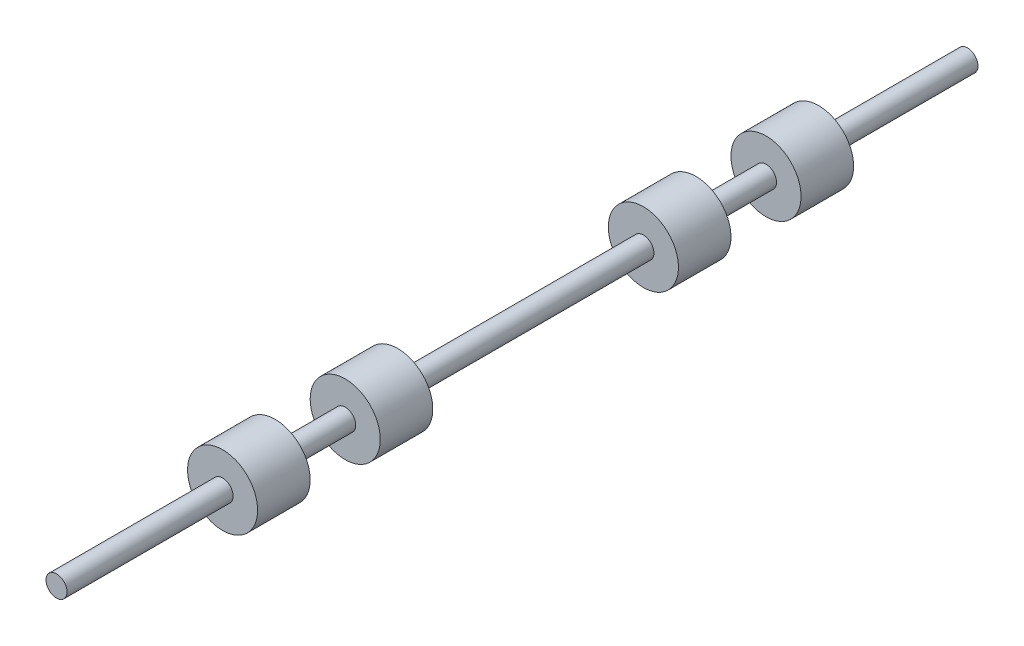
ISO-10303-21;
HEADER;
FILE_DESCRIPTION(('STEP AP214'),'2;1');
FILE_NAME('part.step','',(''),(''),'','','');
FILE_SCHEMA(('AUTOMOTIVE_DESIGN { 1 0 10303 214 1 1 1 1 }'));
ENDSEC;
DATA;
#1=APPLICATION_CONTEXT('core data for automotive mechanical design processes');
#2=APPLICATION_PROTOCOL_DEFINITION('international standard','automotive_design',2000,#1);
#3=PRODUCT_CONTEXT('',#1,'mechanical');
#4=PRODUCT('Part','Part','',(#3));
#5=PRODUCT_RELATED_PRODUCT_CATEGORY('part','',(#4));
#6=PRODUCT_DEFINITION_FORMATION('','',#4);
#7=PRODUCT_DEFINITION_CONTEXT('part definition',#1,'design');
#8=PRODUCT_DEFINITION('design','',#6,#7);
#9=PRODUCT_DEFINITION_SHAPE('','',#8);
#10=(LENGTH_UNIT() NAMED_UNIT(*) SI_UNIT(.MILLI.,.METRE.));
#11=(NAMED_UNIT(*) PLANE_ANGLE_UNIT() SI_UNIT($,.RADIAN.));
#12=(NAMED_UNIT(*) SI_UNIT($,.STERADIAN.) SOLID_ANGLE_UNIT());
#13=UNCERTAINTY_MEASURE_WITH_UNIT(LENGTH_MEASURE(1.E-05),#10,'distance_accuracy_value','');
#14=(GEOMETRIC_REPRESENTATION_CONTEXT(3) GLOBAL_UNCERTAINTY_ASSIGNED_CONTEXT((#13)) GLOBAL_UNIT_ASSIGNED_CONTEXT((#10,
#11,#12)) REPRESENTATION_CONTEXT('',''));
#15=CARTESIAN_POINT('',(0.,0.,0.));
#16=DIRECTION('',(0.,0.,1.));
#17=DIRECTION('',(1.,0.,0.));
#18=AXIS2_PLACEMENT_3D('',#15,#16,#17);
#19=CARTESIAN_POINT('',(0.,0.,26.));
#20=DIRECTION('',(0.,0.,-1.));
#21=DIRECTION('',(-1.,0.,0.));
#22=AXIS2_PLACEMENT_3D('',#19,#20,#21);
#23=CYLINDRICAL_SURFACE('',#22,0.3);
#24=CARTESIAN_POINT('',(0.,0.,17.76));
#25=DIRECTION('',(0.,0.,-1.));
#26=DIRECTION('',(-1.,0.,0.));
#27=AXIS2_PLACEMENT_3D('',#24,#25,#26);
#28=CIRCLE('',#27,0.3);
#29=CARTESIAN_POINT('',(-0.3,0.,17.76));
#30=VERTEX_POINT('',#29);
#31=EDGE_CURVE('E42',#30,#30,#28,.T.);
#32=ORIENTED_EDGE('',*,*,#31,.F.);
#33=EDGE_LOOP('',(#32));
#34=FACE_BOUND('',#33,.T.);
#35=CARTESIAN_POINT('',(0.,0.,19.76));
#36=DIRECTION('',(0.,0.,1.));
#37=DIRECTION('',(1.,0.,0.));
#38=AXIS2_PLACEMENT_3D('',#35,#36,#37);
#39=CIRCLE('',#38,0.3);
#40=CARTESIAN_POINT('',(0.3,0.,19.76));
#41=VERTEX_POINT('',#40);
#42=EDGE_CURVE('E38',#41,#41,#39,.T.);
#43=ORIENTED_EDGE('',*,*,#42,.F.);
#44=EDGE_LOOP('',(#43));
#45=FACE_BOUND('',#44,.T.);
#46=ADVANCED_FACE('F31',(#34,#45),#23,.T.);
#47=CARTESIAN_POINT('',(0.,0.,9.25));
#48=DIRECTION('',(0.,0.,-1.));
#49=DIRECTION('',(-1.,0.,0.));
#50=AXIS2_PLACEMENT_3D('',#47,#48,#49);
#51=CIRCLE('',#50,0.3);
#52=CARTESIAN_POINT('',(-0.3,0.,9.25));
#53=VERTEX_POINT('',#52);
#54=EDGE_CURVE('E51',#53,#53,#51,.T.);
#55=ORIENTED_EDGE('',*,*,#54,.F.);
#56=EDGE_LOOP('',(#55));
#57=FACE_BOUND('',#56,.T.);
#58=CARTESIAN_POINT('',(0.,0.,16.26));
#59=DIRECTION('',(0.,0.,1.));
#60=DIRECTION('',(1.,0.,0.));
#61=AXIS2_PLACEMENT_3D('',#58,#59,#60);
#62=CIRCLE('',#61,0.3);
#63=CARTESIAN_POINT('',(0.3,0.,16.26));
#64=VERTEX_POINT('',#63);
#65=EDGE_CURVE('E46',#64,#64,#62,.T.);
#66=ORIENTED_EDGE('',*,*,#65,.F.);
#67=EDGE_LOOP('',(#66));
#68=FACE_BOUND('',#67,.T.);
#69=ADVANCED_FACE('F113',(#57,#68),#23,.T.);
#70=CARTESIAN_POINT('',(0.,0.,5.75));
#71=DIRECTION('',(0.,0.,-1.));
#72=DIRECTION('',(-1.,0.,0.));
#73=AXIS2_PLACEMENT_3D('',#70,#71,#72);
#74=CIRCLE('',#73,0.3);
#75=CARTESIAN_POINT('',(-0.3,0.,5.75));
#76=VERTEX_POINT('',#75);
#77=EDGE_CURVE('E57',#76,#76,#74,.T.);
#78=ORIENTED_EDGE('',*,*,#77,.F.);
#79=EDGE_LOOP('',(#78));
#80=FACE_BOUND('',#79,.T.);
#81=CARTESIAN_POINT('',(0.,0.,7.75));
#82=DIRECTION('',(0.,0.,1.));
#83=DIRECTION('',(1.,0.,0.));
#84=AXIS2_PLACEMENT_3D('',#81,#82,#83);
#85=CIRCLE('',#84,0.3);
#86=CARTESIAN_POINT('',(0.3,0.,7.75));
#87=VERTEX_POINT('',#86);
#88=EDGE_CURVE('E54',#87,#87,#85,.T.);
#89=ORIENTED_EDGE('',*,*,#88,.F.);
#90=EDGE_LOOP('',(#89));
#91=FACE_BOUND('',#90,.T.);
#92=ADVANCED_FACE('F118',(#80,#91),#23,.T.);
#93=CARTESIAN_POINT('',(0.,0.,5.75));
#94=DIRECTION('',(0.,0.,-1.));
#95=DIRECTION('',(-1.,0.,0.));
#96=AXIS2_PLACEMENT_3D('',#93,#94,#95);
#97=PLANE('',#96);
#98=ORIENTED_EDGE('',*,*,#77,.T.);
#99=EDGE_LOOP('',(#98));
#100=FACE_BOUND('',#99,.T.);
#101=CARTESIAN_POINT('',(0.,0.,5.75));
#102=DIRECTION('',(0.,0.,-1.));
#103=DIRECTION('',(-1.,0.,0.));
#104=AXIS2_PLACEMENT_3D('',#101,#102,#103);
#105=CIRCLE('',#104,1.);
#106=CARTESIAN_POINT('',(-1.,0.,5.75));
#107=VERTEX_POINT('',#106);
#108=EDGE_CURVE('E67',#107,#107,#105,.T.);
#109=ORIENTED_EDGE('',*,*,#108,.F.);
#110=EDGE_LOOP('',(#109));
#111=FACE_BOUND('',#110,.T.);
#112=ADVANCED_FACE('F148',(#100,#111),#97,.F.);
#113=CARTESIAN_POINT('',(0.,0.,0.));
#114=DIRECTION('',(0.,0.,-1.));
#115=DIRECTION('',(-1.,0.,0.));
#116=AXIS2_PLACEMENT_3D('',#113,#114,#115);
#117=CYLINDRICAL_SURFACE('',#116,1.);
#118=CARTESIAN_POINT('',(0.,0.,4.25));
#119=DIRECTION('',(0.,0.,-1.));
#120=DIRECTION('',(-1.,0.,0.));
#121=AXIS2_PLACEMENT_3D('',#118,#119,#120);
#122=CIRCLE('',#121,1.);
#123=CARTESIAN_POINT('',(-1.,0.,4.25));
#124=VERTEX_POINT('',#123);
#125=EDGE_CURVE('E72',#124,#124,#122,.T.);
#126=ORIENTED_EDGE('',*,*,#125,.F.);
#127=EDGE_LOOP('',(#126));
#128=FACE_BOUND('',#127,.T.);
#129=ORIENTED_EDGE('',*,*,#108,.T.);
#130=EDGE_LOOP('',(#129));
#131=FACE_BOUND('',#130,.T.);
#132=ADVANCED_FACE('F153',(#128,#131),#117,.T.);
#133=CARTESIAN_POINT('',(0.,0.,4.25));
#134=DIRECTION('',(0.,0.,1.));
#135=DIRECTION('',(1.,0.,0.));
#136=AXIS2_PLACEMENT_3D('',#133,#134,#135);
#137=PLANE('',#136);
#138=CARTESIAN_POINT('',(0.,0.,4.25));
#139=DIRECTION('',(0.,0.,1.));
#140=DIRECTION('',(1.,0.,0.));
#141=AXIS2_PLACEMENT_3D('',#138,#139,#140);
#142=CIRCLE('',#141,0.3);
#143=CARTESIAN_POINT('',(0.3,0.,4.25));
#144=VERTEX_POINT('',#143);
#145=EDGE_CURVE('E60',#144,#144,#142,.T.);
#146=ORIENTED_EDGE('',*,*,#145,.T.);
#147=EDGE_LOOP('',(#146));
#148=FACE_BOUND('',#147,.T.);
#149=ORIENTED_EDGE('',*,*,#125,.T.);
#150=EDGE_LOOP('',(#149));
#151=FACE_BOUND('',#150,.T.);
#152=ADVANCED_FACE('F144',(#148,#151),#137,.F.);
#153=CARTESIAN_POINT('',(0.,0.,0.));
#154=DIRECTION('',(0.,0.,1.));
#155=DIRECTION('',(1.,0.,0.));
#156=AXIS2_PLACEMENT_3D('',#153,#154,#155);
#157=PLANE('',#156);
#158=CARTESIAN_POINT('',(0.,0.,0.));
#159=DIRECTION('',(0.,0.,1.));
#160=DIRECTION('',(1.,0.,0.));
#161=AXIS2_PLACEMENT_3D('',#158,#159,#160);
#162=CIRCLE('',#161,0.3);
#163=CARTESIAN_POINT('',(0.3,0.,0.));
#164=VERTEX_POINT('',#163);
#165=EDGE_CURVE('E64',#164,#164,#162,.T.);
#166=ORIENTED_EDGE('',*,*,#165,.F.);
#167=EDGE_LOOP('',(#166));
#168=FACE_BOUND('',#167,.T.);
#169=ADVANCED_FACE('F135',(#168),#157,.F.);
#170=ORIENTED_EDGE('',*,*,#165,.T.);
#171=EDGE_LOOP('',(#170));
#172=FACE_BOUND('',#171,.T.);
#173=ORIENTED_EDGE('',*,*,#145,.F.);
#174=EDGE_LOOP('',(#173));
#175=FACE_BOUND('',#174,.T.);
#176=ADVANCED_FACE('F125',(#172,#175),#23,.T.);
#177=CARTESIAN_POINT('',(0.,0.,9.25));
#178=DIRECTION('',(0.,0.,-1.));
#179=DIRECTION('',(-1.,0.,0.));
#180=AXIS2_PLACEMENT_3D('',#177,#178,#179);
#181=PLANE('',#180);
#182=ORIENTED_EDGE('',*,*,#54,.T.);
#183=EDGE_LOOP('',(#182));
#184=FACE_BOUND('',#183,.T.);
#185=CARTESIAN_POINT('',(0.,0.,9.25));
#186=DIRECTION('',(0.,0.,-1.));
#187=DIRECTION('',(-1.,0.,0.));
#188=AXIS2_PLACEMENT_3D('',#185,#186,#187);
#189=CIRCLE('',#188,1.);
#190=CARTESIAN_POINT('',(-1.,0.,9.25));
#191=VERTEX_POINT('',#190);
#192=EDGE_CURVE('E75',#191,#191,#189,.T.);
#193=ORIENTED_EDGE('',*,*,#192,.F.);
#194=EDGE_LOOP('',(#193));
#195=FACE_BOUND('',#194,.T.);
#196=ADVANCED_FACE('F134',(#184,#195),#181,.F.);
#197=CARTESIAN_POINT('',(0.,0.,0.));
#198=DIRECTION('',(0.,0.,-1.));
#199=DIRECTION('',(-1.,0.,0.));
#200=AXIS2_PLACEMENT_3D('',#197,#198,#199);
#201=CYLINDRICAL_SURFACE('',#200,1.);
#202=CARTESIAN_POINT('',(0.,0.,7.75));
#203=DIRECTION('',(0.,0.,-1.));
#204=DIRECTION('',(-1.,0.,0.));
#205=AXIS2_PLACEMENT_3D('',#202,#203,#204);
#206=CIRCLE('',#205,1.);
#207=CARTESIAN_POINT('',(-1.,0.,7.75));
#208=VERTEX_POINT('',#207);
#209=EDGE_CURVE('E78',#208,#208,#206,.T.);
#210=ORIENTED_EDGE('',*,*,#209,.F.);
#211=EDGE_LOOP('',(#210));
#212=FACE_BOUND('',#211,.T.);
#213=ORIENTED_EDGE('',*,*,#192,.T.);
#214=EDGE_LOOP('',(#213));
#215=FACE_BOUND('',#214,.T.);
#216=ADVANCED_FACE('F141',(#212,#215),#201,.T.);
#217=CARTESIAN_POINT('',(0.,0.,7.75));
#218=DIRECTION('',(0.,0.,1.));
#219=DIRECTION('',(1.,0.,0.));
#220=AXIS2_PLACEMENT_3D('',#217,#218,#219);
#221=PLANE('',#220);
#222=ORIENTED_EDGE('',*,*,#88,.T.);
#223=EDGE_LOOP('',(#222));
#224=FACE_BOUND('',#223,.T.);
#225=ORIENTED_EDGE('',*,*,#209,.T.);
#226=EDGE_LOOP('',(#225));
#227=FACE_BOUND('',#226,.T.);
#228=ADVANCED_FACE('F160',(#224,#227),#221,.F.);
#229=CARTESIAN_POINT('',(0.,0.,17.76));
#230=DIRECTION('',(0.,0.,-1.));
#231=DIRECTION('',(-1.,0.,0.));
#232=AXIS2_PLACEMENT_3D('',#229,#230,#231);
#233=PLANE('',#232);
#234=ORIENTED_EDGE('',*,*,#31,.T.);
#235=EDGE_LOOP('',(#234));
#236=FACE_BOUND('',#235,.T.);
#237=CARTESIAN_POINT('',(0.,0.,17.76));
#238=DIRECTION('',(0.,0.,-1.));
#239=DIRECTION('',(-1.,0.,0.));
#240=AXIS2_PLACEMENT_3D('',#237,#238,#239);
#241=CIRCLE('',#240,1.);
#242=CARTESIAN_POINT('',(-1.,0.,17.76));
#243=VERTEX_POINT('',#242);
#244=EDGE_CURVE('E81',#243,#243,#241,.T.);
#245=ORIENTED_EDGE('',*,*,#244,.F.);
#246=EDGE_LOOP('',(#245));
#247=FACE_BOUND('',#246,.T.);
#248=ADVANCED_FACE('F163',(#236,#247),#233,.F.);
#249=CARTESIAN_POINT('',(0.,0.,0.));
#250=DIRECTION('',(0.,0.,-1.));
#251=DIRECTION('',(-1.,0.,0.));
#252=AXIS2_PLACEMENT_3D('',#249,#250,#251);
#253=CYLINDRICAL_SURFACE('',#252,1.);
#254=CARTESIAN_POINT('',(0.,0.,16.26));
#255=DIRECTION('',(0.,0.,-1.));
#256=DIRECTION('',(-1.,0.,0.));
#257=AXIS2_PLACEMENT_3D('',#254,#255,#256);
#258=CIRCLE('',#257,1.);
#259=CARTESIAN_POINT('',(-1.,0.,16.26));
#260=VERTEX_POINT('',#259);
#261=EDGE_CURVE('E84',#260,#260,#258,.T.);
#262=ORIENTED_EDGE('',*,*,#261,.F.);
#263=EDGE_LOOP('',(#262));
#264=FACE_BOUND('',#263,.T.);
#265=ORIENTED_EDGE('',*,*,#244,.T.);
#266=EDGE_LOOP('',(#265));
#267=FACE_BOUND('',#266,.T.);
#268=ADVANCED_FACE('F109',(#264,#267),#253,.T.);
#269=CARTESIAN_POINT('',(0.,0.,16.26));
#270=DIRECTION('',(0.,0.,1.));
#271=DIRECTION('',(1.,0.,0.));
#272=AXIS2_PLACEMENT_3D('',#269,#270,#271);
#273=PLANE('',#272);
#274=ORIENTED_EDGE('',*,*,#65,.T.);
#275=EDGE_LOOP('',(#274));
#276=FACE_BOUND('',#275,.T.);
#277=ORIENTED_EDGE('',*,*,#261,.T.);
#278=EDGE_LOOP('',(#277));
#279=FACE_BOUND('',#278,.T.);
#280=ADVANCED_FACE('F104',(#276,#279),#273,.F.);
#281=CARTESIAN_POINT('',(0.,0.,21.26));
#282=DIRECTION('',(0.,0.,-1.));
#283=DIRECTION('',(-1.,0.,0.));
#284=AXIS2_PLACEMENT_3D('',#281,#282,#283);
#285=PLANE('',#284);
#286=CARTESIAN_POINT('',(0.,0.,21.26));
#287=DIRECTION('',(0.,0.,-1.));
#288=DIRECTION('',(-1.,0.,0.));
#289=AXIS2_PLACEMENT_3D('',#286,#287,#288);
#290=CIRCLE('',#289,0.3);
#291=CARTESIAN_POINT('',(-0.3,0.,21.26));
#292=VERTEX_POINT('',#291);
#293=EDGE_CURVE('E10',#292,#292,#290,.T.);
#294=ORIENTED_EDGE('',*,*,#293,.T.);
#295=EDGE_LOOP('',(#294));
#296=FACE_BOUND('',#295,.T.);
#297=CARTESIAN_POINT('',(0.,0.,21.26));
#298=DIRECTION('',(0.,0.,-1.));
#299=DIRECTION('',(-1.,0.,0.));
#300=AXIS2_PLACEMENT_3D('',#297,#298,#299);
#301=CIRCLE('',#300,1.);
#302=CARTESIAN_POINT('',(-1.,0.,21.26));
#303=VERTEX_POINT('',#302);
#304=EDGE_CURVE('E87',#303,#303,#301,.T.);
#305=ORIENTED_EDGE('',*,*,#304,.F.);
#306=EDGE_LOOP('',(#305));
#307=FACE_BOUND('',#306,.T.);
#308=ADVANCED_FACE('F99',(#296,#307),#285,.F.);
#309=CARTESIAN_POINT('',(0.,0.,0.));
#310=DIRECTION('',(0.,0.,-1.));
#311=DIRECTION('',(-1.,0.,0.));
#312=AXIS2_PLACEMENT_3D('',#309,#310,#311);
#313=CYLINDRICAL_SURFACE('',#312,1.);
#314=CARTESIAN_POINT('',(0.,0.,19.76));
#315=DIRECTION('',(0.,0.,-1.));
#316=DIRECTION('',(-1.,0.,0.));
#317=AXIS2_PLACEMENT_3D('',#314,#315,#316);
#318=CIRCLE('',#317,1.);
#319=CARTESIAN_POINT('',(-1.,0.,19.76));
#320=VERTEX_POINT('',#319);
#321=EDGE_CURVE('E90',#320,#320,#318,.T.);
#322=ORIENTED_EDGE('',*,*,#321,.F.);
#323=EDGE_LOOP('',(#322));
#324=FACE_BOUND('',#323,.T.);
#325=ORIENTED_EDGE('',*,*,#304,.T.);
#326=EDGE_LOOP('',(#325));
#327=FACE_BOUND('',#326,.T.);
#328=ADVANCED_FACE('F96',(#324,#327),#313,.T.);
#329=CARTESIAN_POINT('',(0.,0.,19.76));
#330=DIRECTION('',(0.,0.,1.));
#331=DIRECTION('',(1.,0.,0.));
#332=AXIS2_PLACEMENT_3D('',#329,#330,#331);
#333=PLANE('',#332);
#334=ORIENTED_EDGE('',*,*,#42,.T.);
#335=EDGE_LOOP('',(#334));
#336=FACE_BOUND('',#335,.T.);
#337=ORIENTED_EDGE('',*,*,#321,.T.);
#338=EDGE_LOOP('',(#337));
#339=FACE_BOUND('',#338,.T.);
#340=ADVANCED_FACE('F94',(#336,#339),#333,.F.);
#341=CARTESIAN_POINT('',(0.,0.,26.));
#342=DIRECTION('',(0.,0.,1.));
#343=DIRECTION('',(1.,0.,0.));
#344=AXIS2_PLACEMENT_3D('',#341,#342,#343);
#345=PLANE('',#344);
#346=CARTESIAN_POINT('',(0.,0.,26.));
#347=DIRECTION('',(0.,0.,1.));
#348=DIRECTION('',(1.,0.,0.));
#349=AXIS2_PLACEMENT_3D('',#346,#347,#348);
#350=CIRCLE('',#349,0.3);
#351=CARTESIAN_POINT('',(0.3,0.,26.));
#352=VERTEX_POINT('',#351);
#353=EDGE_CURVE('E63',#352,#352,#350,.T.);
#354=ORIENTED_EDGE('',*,*,#353,.T.);
#355=EDGE_LOOP('',(#354));
#356=FACE_BOUND('',#355,.T.);
#357=ADVANCED_FACE('F123',(#356),#345,.T.);
#358=ORIENTED_EDGE('',*,*,#353,.F.);
#359=EDGE_LOOP('',(#358));
#360=FACE_BOUND('',#359,.T.);
#361=ORIENTED_EDGE('',*,*,#293,.F.);
#362=EDGE_LOOP('',(#361));
#363=FACE_BOUND('',#362,.T.);
#364=ADVANCED_FACE('F33',(#360,#363),#23,.T.);
#365=CLOSED_SHELL('',(#46,#69,#92,#112,#132,#152,#169,#176,#196,#216,#228,#248,#268,#280,#308,
#328,#340,#357,#364));
#366=MANIFOLD_SOLID_BREP('B2',#365);
#367=ADVANCED_BREP_SHAPE_REPRESENTATION('',(#18,#366),#14);
#368=SHAPE_DEFINITION_REPRESENTATION(#9,#367);
ENDSEC;
END-ISO-10303-21;
